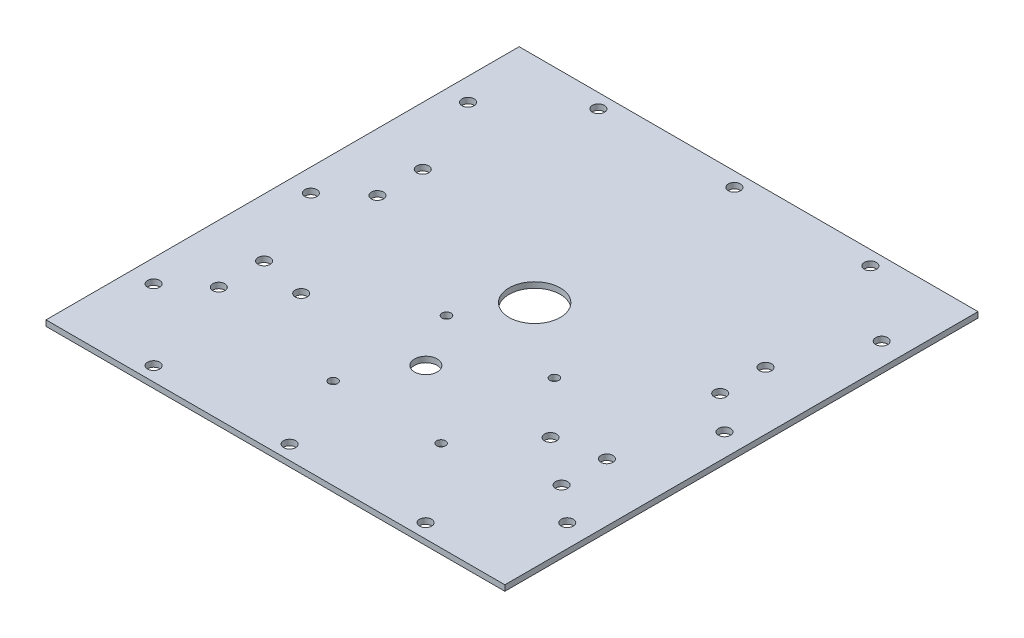
ISO-10303-21;
HEADER;
FILE_DESCRIPTION(('STEP AP214'),'2;1');
FILE_NAME('part.step','',(''),(''),'','','');
FILE_SCHEMA(('AUTOMOTIVE_DESIGN { 1 0 10303 214 1 1 1 1 }'));
ENDSEC;
DATA;
#1=APPLICATION_CONTEXT('core data for automotive mechanical design processes');
#2=APPLICATION_PROTOCOL_DEFINITION('international standard','automotive_design',2000,#1);
#3=PRODUCT_CONTEXT('',#1,'mechanical');
#4=PRODUCT('Part','Part','',(#3));
#5=PRODUCT_RELATED_PRODUCT_CATEGORY('part','',(#4));
#6=PRODUCT_DEFINITION_FORMATION('','',#4);
#7=PRODUCT_DEFINITION_CONTEXT('part definition',#1,'design');
#8=PRODUCT_DEFINITION('design','',#6,#7);
#9=PRODUCT_DEFINITION_SHAPE('','',#8);
#10=(LENGTH_UNIT() NAMED_UNIT(*) SI_UNIT(.MILLI.,.METRE.));
#11=(NAMED_UNIT(*) PLANE_ANGLE_UNIT() SI_UNIT($,.RADIAN.));
#12=(NAMED_UNIT(*) SI_UNIT($,.STERADIAN.) SOLID_ANGLE_UNIT());
#13=UNCERTAINTY_MEASURE_WITH_UNIT(LENGTH_MEASURE(1.E-05),#10,'distance_accuracy_value','');
#14=(GEOMETRIC_REPRESENTATION_CONTEXT(3) GLOBAL_UNCERTAINTY_ASSIGNED_CONTEXT((#13)) GLOBAL_UNIT_ASSIGNED_CONTEXT((#10,
#11,#12)) REPRESENTATION_CONTEXT('',''));
#15=CARTESIAN_POINT('',(0.,0.,0.));
#16=DIRECTION('',(0.,0.,1.));
#17=DIRECTION('',(1.,0.,0.));
#18=AXIS2_PLACEMENT_3D('',#15,#16,#17);
#19=CARTESIAN_POINT('',(-315.9125,-3.175,-265.1125));
#20=DIRECTION('',(0.,0.,-1.));
#21=DIRECTION('',(-1.,0.,0.));
#22=AXIS2_PLACEMENT_3D('',#19,#20,#21);
#23=PLANE('',#22);
#24=DIRECTION('',(0.,1.,0.));
#25=VECTOR('',#24,1.);
#26=CARTESIAN_POINT('',(-286.5125,-3.175,-265.1125));
#27=LINE('',#26,#25);
#28=CARTESIAN_POINT('',(-286.5125,-3.175,-265.1125));
#29=VERTEX_POINT('',#28);
#30=CARTESIAN_POINT('',(-286.5125,0.,-265.1125));
#31=VERTEX_POINT('',#30);
#32=EDGE_CURVE('E83',#29,#31,#27,.T.);
#33=ORIENTED_EDGE('',*,*,#32,.T.);
#34=DIRECTION('',(-1.,0.,0.));
#35=VECTOR('',#34,1.);
#36=CARTESIAN_POINT('',(-315.9125,0.,-265.1125));
#37=LINE('',#36,#35);
#38=CARTESIAN_POINT('',(-29.4,0.,-265.1125));
#39=VERTEX_POINT('',#38);
#40=EDGE_CURVE('E43',#39,#31,#37,.T.);
#41=ORIENTED_EDGE('',*,*,#40,.F.);
#42=DIRECTION('',(0.,1.,0.));
#43=VECTOR('',#42,1.);
#44=CARTESIAN_POINT('',(-29.4,-3.175,-265.1125));
#45=LINE('',#44,#43);
#46=CARTESIAN_POINT('',(-29.4,-3.175,-265.1125));
#47=VERTEX_POINT('',#46);
#48=EDGE_CURVE('E56',#47,#39,#45,.T.);
#49=ORIENTED_EDGE('',*,*,#48,.F.);
#50=DIRECTION('',(-1.,0.,0.));
#51=VECTOR('',#50,1.);
#52=CARTESIAN_POINT('',(-315.9125,-3.175,-265.1125));
#53=LINE('',#52,#51);
#54=EDGE_CURVE('E11',#47,#29,#53,.T.);
#55=ORIENTED_EDGE('',*,*,#54,.T.);
#56=EDGE_LOOP('',(#33,#41,#49,#55));
#57=FACE_BOUND('',#56,.T.);
#58=ADVANCED_FACE('F39',(#57),#23,.T.);
#59=CARTESIAN_POINT('',(-315.9125,-3.175,0.));
#60=DIRECTION('',(0.,0.,1.));
#61=DIRECTION('',(1.,0.,0.));
#62=AXIS2_PLACEMENT_3D('',#59,#60,#61);
#63=PLANE('',#62);
#64=DIRECTION('',(0.,1.,0.));
#65=VECTOR('',#64,1.);
#66=CARTESIAN_POINT('',(-286.5125,-3.175,0.));
#67=LINE('',#66,#65);
#68=CARTESIAN_POINT('',(-286.5125,-3.175,0.));
#69=VERTEX_POINT('',#68);
#70=CARTESIAN_POINT('',(-286.5125,0.,0.));
#71=VERTEX_POINT('',#70);
#72=EDGE_CURVE('E64',#69,#71,#67,.T.);
#73=ORIENTED_EDGE('',*,*,#72,.F.);
#74=DIRECTION('',(1.,0.,0.));
#75=VECTOR('',#74,1.);
#76=CARTESIAN_POINT('',(-315.9125,-3.175,0.));
#77=LINE('',#76,#75);
#78=CARTESIAN_POINT('',(-29.4,-3.175,0.));
#79=VERTEX_POINT('',#78);
#80=EDGE_CURVE('E48',#69,#79,#77,.T.);
#81=ORIENTED_EDGE('',*,*,#80,.T.);
#82=DIRECTION('',(0.,1.,0.));
#83=VECTOR('',#82,1.);
#84=CARTESIAN_POINT('',(-29.4,-3.175,0.));
#85=LINE('',#84,#83);
#86=CARTESIAN_POINT('',(-29.4,0.,0.));
#87=VERTEX_POINT('',#86);
#88=EDGE_CURVE('E275',#79,#87,#85,.T.);
#89=ORIENTED_EDGE('',*,*,#88,.T.);
#90=DIRECTION('',(1.,0.,0.));
#91=VECTOR('',#90,1.);
#92=CARTESIAN_POINT('',(-315.9125,0.,0.));
#93=LINE('',#92,#91);
#94=EDGE_CURVE('E94',#71,#87,#93,.T.);
#95=ORIENTED_EDGE('',*,*,#94,.F.);
#96=EDGE_LOOP('',(#73,#81,#89,#95));
#97=FACE_BOUND('',#96,.T.);
#98=ADVANCED_FACE('F41',(#97),#63,.T.);
#99=CARTESIAN_POINT('',(0.,-3.175,0.));
#100=DIRECTION('',(0.,-1.,0.));
#101=DIRECTION('',(0.,0.,-1.));
#102=AXIS2_PLACEMENT_3D('',#99,#100,#101);
#103=PLANE('',#102);
#104=DIRECTION('',(0.,0.,-1.));
#105=VECTOR('',#104,1.);
#106=CARTESIAN_POINT('',(-286.5125,-3.175,-265.1125));
#107=LINE('',#106,#105);
#108=EDGE_CURVE('E80',#69,#29,#107,.T.);
#109=ORIENTED_EDGE('',*,*,#108,.T.);
#110=ORIENTED_EDGE('',*,*,#54,.F.);
#111=DIRECTION('',(0.,0.,1.));
#112=VECTOR('',#111,1.);
#113=CARTESIAN_POINT('',(-29.4,-3.175,-265.1125));
#114=LINE('',#113,#112);
#115=EDGE_CURVE('E99',#47,#79,#114,.T.);
#116=ORIENTED_EDGE('',*,*,#115,.T.);
#117=ORIENTED_EDGE('',*,*,#80,.F.);
#118=EDGE_LOOP('',(#109,#110,#116,#117));
#119=FACE_BOUND('',#118,.T.);
#120=CARTESIAN_POINT('',(-42.06875,-3.175,-47.625));
#121=DIRECTION('',(0.,1.,0.));
#122=DIRECTION('',(0.,0.,-1.));
#123=AXIS2_PLACEMENT_3D('',#120,#121,#122);
#124=CIRCLE('',#123,3.37820000000002);
#125=CARTESIAN_POINT('',(-42.06875,-3.175,-51.0032));
#126=VERTEX_POINT('',#125);
#127=EDGE_CURVE('E266',#126,#126,#124,.T.);
#128=ORIENTED_EDGE('',*,*,#127,.T.);
#129=EDGE_LOOP('',(#128));
#130=FACE_BOUND('',#129,.T.);
#131=CARTESIAN_POINT('',(-42.06875,-3.175,-135.73125));
#132=DIRECTION('',(0.,1.,0.));
#133=DIRECTION('',(0.,0.,-1.));
#134=AXIS2_PLACEMENT_3D('',#131,#132,#133);
#135=CIRCLE('',#134,3.37819999999999);
#136=CARTESIAN_POINT('',(-42.06875,-3.175,-139.10945));
#137=VERTEX_POINT('',#136);
#138=EDGE_CURVE('E260',#137,#137,#135,.T.);
#139=ORIENTED_EDGE('',*,*,#138,.T.);
#140=EDGE_LOOP('',(#139));
#141=FACE_BOUND('',#140,.T.);
#142=CARTESIAN_POINT('',(-42.06875,-3.175,-223.8375));
#143=DIRECTION('',(0.,1.,0.));
#144=DIRECTION('',(0.,0.,-1.));
#145=AXIS2_PLACEMENT_3D('',#142,#143,#144);
#146=CIRCLE('',#145,3.37819999999999);
#147=CARTESIAN_POINT('',(-42.06875,-3.175,-227.2157));
#148=VERTEX_POINT('',#147);
#149=EDGE_CURVE('E254',#148,#148,#146,.T.);
#150=ORIENTED_EDGE('',*,*,#149,.T.);
#151=EDGE_LOOP('',(#150));
#152=FACE_BOUND('',#151,.T.);
#153=CARTESIAN_POINT('',(-273.84375,-3.175,-47.625));
#154=DIRECTION('',(0.,1.,0.));
#155=DIRECTION('',(0.,0.,1.));
#156=AXIS2_PLACEMENT_3D('',#153,#154,#155);
#157=CIRCLE('',#156,3.37819999999999);
#158=CARTESIAN_POINT('',(-273.84375,-3.175,-44.2468));
#159=VERTEX_POINT('',#158);
#160=EDGE_CURVE('E248',#159,#159,#157,.T.);
#161=ORIENTED_EDGE('',*,*,#160,.T.);
#162=EDGE_LOOP('',(#161));
#163=FACE_BOUND('',#162,.T.);
#164=CARTESIAN_POINT('',(-273.84375,-3.175,-135.73125));
#165=DIRECTION('',(0.,1.,0.));
#166=DIRECTION('',(0.,0.,1.));
#167=AXIS2_PLACEMENT_3D('',#164,#165,#166);
#168=CIRCLE('',#167,3.37819999999999);
#169=CARTESIAN_POINT('',(-273.84375,-3.175,-132.35305));
#170=VERTEX_POINT('',#169);
#171=EDGE_CURVE('E242',#170,#170,#168,.T.);
#172=ORIENTED_EDGE('',*,*,#171,.T.);
#173=EDGE_LOOP('',(#172));
#174=FACE_BOUND('',#173,.T.);
#175=CARTESIAN_POINT('',(-273.84375,-3.175,-223.8375));
#176=DIRECTION('',(0.,1.,0.));
#177=DIRECTION('',(0.,0.,1.));
#178=AXIS2_PLACEMENT_3D('',#175,#176,#177);
#179=CIRCLE('',#178,3.37819999999999);
#180=CARTESIAN_POINT('',(-273.84375,-3.175,-220.4593));
#181=VERTEX_POINT('',#180);
#182=EDGE_CURVE('E236',#181,#181,#179,.T.);
#183=ORIENTED_EDGE('',*,*,#182,.T.);
#184=EDGE_LOOP('',(#183));
#185=FACE_BOUND('',#184,.T.);
#186=CARTESIAN_POINT('',(-88.10625,-3.175,-84.29625));
#187=DIRECTION('',(0.,1.,0.));
#188=DIRECTION('',(0.,0.,1.));
#189=AXIS2_PLACEMENT_3D('',#186,#187,#188);
#190=CIRCLE('',#189,3.37819999999999);
#191=CARTESIAN_POINT('',(-88.10625,-3.175,-80.91805));
#192=VERTEX_POINT('',#191);
#193=EDGE_CURVE('E230',#192,#192,#190,.T.);
#194=ORIENTED_EDGE('',*,*,#193,.T.);
#195=EDGE_LOOP('',(#194));
#196=FACE_BOUND('',#195,.T.);
#197=CARTESIAN_POINT('',(-227.80625,-3.175,-84.29625));
#198=DIRECTION('',(0.,1.,0.));
#199=DIRECTION('',(0.,0.,1.));
#200=AXIS2_PLACEMENT_3D('',#197,#198,#199);
#201=CIRCLE('',#200,3.37819999999999);
#202=CARTESIAN_POINT('',(-227.80625,-3.175,-80.91805));
#203=VERTEX_POINT('',#202);
#204=EDGE_CURVE('E224',#203,#203,#201,.T.);
#205=ORIENTED_EDGE('',*,*,#204,.T.);
#206=EDGE_LOOP('',(#205));
#207=FACE_BOUND('',#206,.T.);
#208=CARTESIAN_POINT('',(-234.15625,-3.175,-257.175));
#209=DIRECTION('',(0.,1.,0.));
#210=DIRECTION('',(0.,0.,1.));
#211=AXIS2_PLACEMENT_3D('',#208,#209,#210);
#212=CIRCLE('',#211,3.37819999999999);
#213=CARTESIAN_POINT('',(-234.15625,-3.175,-253.7968));
#214=VERTEX_POINT('',#213);
#215=EDGE_CURVE('E218',#214,#214,#212,.T.);
#216=ORIENTED_EDGE('',*,*,#215,.T.);
#217=EDGE_LOOP('',(#216));
#218=FACE_BOUND('',#217,.T.);
#219=CARTESIAN_POINT('',(-81.75625,-3.175,-257.175));
#220=DIRECTION('',(0.,1.,0.));
#221=DIRECTION('',(0.,0.,1.));
#222=AXIS2_PLACEMENT_3D('',#219,#220,#221);
#223=CIRCLE('',#222,3.37819999999999);
#224=CARTESIAN_POINT('',(-81.75625,-3.175,-253.7968));
#225=VERTEX_POINT('',#224);
#226=EDGE_CURVE('E212',#225,#225,#223,.T.);
#227=ORIENTED_EDGE('',*,*,#226,.T.);
#228=EDGE_LOOP('',(#227));
#229=FACE_BOUND('',#228,.T.);
#230=CARTESIAN_POINT('',(-157.95625,-3.175,-257.175));
#231=DIRECTION('',(0.,1.,0.));
#232=DIRECTION('',(0.,0.,1.));
#233=AXIS2_PLACEMENT_3D('',#230,#231,#232);
#234=CIRCLE('',#233,3.37819999999999);
#235=CARTESIAN_POINT('',(-157.95625,-3.175,-253.7968));
#236=VERTEX_POINT('',#235);
#237=EDGE_CURVE('E206',#236,#236,#234,.T.);
#238=ORIENTED_EDGE('',*,*,#237,.T.);
#239=EDGE_LOOP('',(#238));
#240=FACE_BOUND('',#239,.T.);
#241=CARTESIAN_POINT('',(-81.75625,-3.175,-7.93750000000004));
#242=DIRECTION('',(0.,1.,0.));
#243=DIRECTION('',(0.,0.,1.));
#244=AXIS2_PLACEMENT_3D('',#241,#242,#243);
#245=CIRCLE('',#244,3.37819999999999);
#246=CARTESIAN_POINT('',(-81.75625,-3.175,-4.55930000000005));
#247=VERTEX_POINT('',#246);
#248=EDGE_CURVE('E200',#247,#247,#245,.T.);
#249=ORIENTED_EDGE('',*,*,#248,.T.);
#250=EDGE_LOOP('',(#249));
#251=FACE_BOUND('',#250,.T.);
#252=CARTESIAN_POINT('',(-157.95625,-3.175,-7.9375));
#253=DIRECTION('',(0.,1.,0.));
#254=DIRECTION('',(0.,0.,1.));
#255=AXIS2_PLACEMENT_3D('',#252,#253,#254);
#256=CIRCLE('',#255,3.37819999999999);
#257=CARTESIAN_POINT('',(-157.95625,-3.175,-4.55930000000001));
#258=VERTEX_POINT('',#257);
#259=EDGE_CURVE('E194',#258,#258,#256,.T.);
#260=ORIENTED_EDGE('',*,*,#259,.T.);
#261=EDGE_LOOP('',(#260));
#262=FACE_BOUND('',#261,.T.);
#263=CARTESIAN_POINT('',(-234.15625,-3.175,-7.93750000000004));
#264=DIRECTION('',(0.,1.,0.));
#265=DIRECTION('',(0.,0.,1.));
#266=AXIS2_PLACEMENT_3D('',#263,#264,#265);
#267=CIRCLE('',#266,3.37819999999999);
#268=CARTESIAN_POINT('',(-234.15625,-3.175,-4.55930000000005));
#269=VERTEX_POINT('',#268);
#270=EDGE_CURVE('E188',#269,#269,#267,.T.);
#271=ORIENTED_EDGE('',*,*,#270,.T.);
#272=EDGE_LOOP('',(#271));
#273=FACE_BOUND('',#272,.T.);
#274=CARTESIAN_POINT('',(-176.37125,-3.175,-50.76825));
#275=DIRECTION('',(0.,1.,0.));
#276=DIRECTION('',(0.,0.,1.));
#277=AXIS2_PLACEMENT_3D('',#274,#275,#276);
#278=CIRCLE('',#277,2.4892);
#279=CARTESIAN_POINT('',(-176.37125,-3.175,-48.27905));
#280=VERTEX_POINT('',#279);
#281=EDGE_CURVE('E182',#280,#280,#278,.T.);
#282=ORIENTED_EDGE('',*,*,#281,.T.);
#283=EDGE_LOOP('',(#282));
#284=FACE_BOUND('',#283,.T.);
#285=CARTESIAN_POINT('',(-115.91925,-3.175,-50.76825));
#286=DIRECTION('',(0.,1.,0.));
#287=DIRECTION('',(0.,0.,1.));
#288=AXIS2_PLACEMENT_3D('',#285,#286,#287);
#289=CIRCLE('',#288,2.4892);
#290=CARTESIAN_POINT('',(-115.91925,-3.175,-48.27905));
#291=VERTEX_POINT('',#290);
#292=EDGE_CURVE('E176',#291,#291,#289,.T.);
#293=ORIENTED_EDGE('',*,*,#292,.T.);
#294=EDGE_LOOP('',(#293));
#295=FACE_BOUND('',#294,.T.);
#296=CARTESIAN_POINT('',(-115.91925,-3.175,-114.26825));
#297=DIRECTION('',(0.,1.,0.));
#298=DIRECTION('',(0.,0.,1.));
#299=AXIS2_PLACEMENT_3D('',#296,#297,#298);
#300=CIRCLE('',#299,2.4892);
#301=CARTESIAN_POINT('',(-115.91925,-3.175,-111.77905));
#302=VERTEX_POINT('',#301);
#303=EDGE_CURVE('E170',#302,#302,#300,.T.);
#304=ORIENTED_EDGE('',*,*,#303,.T.);
#305=EDGE_LOOP('',(#304));
#306=FACE_BOUND('',#305,.T.);
#307=CARTESIAN_POINT('',(-176.37125,-3.175,-114.26825));
#308=DIRECTION('',(0.,1.,0.));
#309=DIRECTION('',(0.,0.,1.));
#310=AXIS2_PLACEMENT_3D('',#307,#308,#309);
#311=CIRCLE('',#310,2.4892);
#312=CARTESIAN_POINT('',(-176.37125,-3.175,-111.77905));
#313=VERTEX_POINT('',#312);
#314=EDGE_CURVE('E164',#313,#313,#311,.T.);
#315=ORIENTED_EDGE('',*,*,#314,.T.);
#316=EDGE_LOOP('',(#315));
#317=FACE_BOUND('',#316,.T.);
#318=CARTESIAN_POINT('',(-157.95625,-3.175,-84.29625));
#319=DIRECTION('',(0.,1.,0.));
#320=DIRECTION('',(0.,0.,1.));
#321=AXIS2_PLACEMENT_3D('',#318,#319,#320);
#322=CIRCLE('',#321,6.34999999999999);
#323=CARTESIAN_POINT('',(-157.95625,-3.175,-77.94625));
#324=VERTEX_POINT('',#323);
#325=EDGE_CURVE('E158',#324,#324,#322,.T.);
#326=ORIENTED_EDGE('',*,*,#325,.T.);
#327=EDGE_LOOP('',(#326));
#328=FACE_BOUND('',#327,.T.);
#329=CARTESIAN_POINT('',(-157.95625,-3.175,-145.25625));
#330=DIRECTION('',(0.,1.,0.));
#331=DIRECTION('',(0.,0.,1.));
#332=AXIS2_PLACEMENT_3D('',#329,#330,#331);
#333=CIRCLE('',#332,14.351);
#334=CARTESIAN_POINT('',(-157.95625,-3.175,-130.90525));
#335=VERTEX_POINT('',#334);
#336=EDGE_CURVE('E152',#335,#335,#333,.T.);
#337=ORIENTED_EDGE('',*,*,#336,.T.);
#338=EDGE_LOOP('',(#337));
#339=FACE_BOUND('',#338,.T.);
#340=CARTESIAN_POINT('',(-61.9125,-3.175,-178.59375));
#341=DIRECTION('',(0.,1.,0.));
#342=DIRECTION('',(0.,0.,-1.));
#343=AXIS2_PLACEMENT_3D('',#340,#341,#342);
#344=CIRCLE('',#343,3.37819999999999);
#345=CARTESIAN_POINT('',(-61.9125,-3.175,-181.97195));
#346=VERTEX_POINT('',#345);
#347=EDGE_CURVE('E146',#346,#346,#344,.T.);
#348=ORIENTED_EDGE('',*,*,#347,.T.);
#349=EDGE_LOOP('',(#348));
#350=FACE_BOUND('',#349,.T.);
#351=CARTESIAN_POINT('',(-61.9125,-3.175,-153.19375));
#352=DIRECTION('',(0.,1.,0.));
#353=DIRECTION('',(0.,0.,-1.));
#354=AXIS2_PLACEMENT_3D('',#351,#352,#353);
#355=CIRCLE('',#354,3.37820000000002);
#356=CARTESIAN_POINT('',(-61.9125,-3.175,-156.57195));
#357=VERTEX_POINT('',#356);
#358=EDGE_CURVE('E140',#357,#357,#355,.T.);
#359=ORIENTED_EDGE('',*,*,#358,.T.);
#360=EDGE_LOOP('',(#359));
#361=FACE_BOUND('',#360,.T.);
#362=CARTESIAN_POINT('',(-61.9125,-3.175,-89.69375));
#363=DIRECTION('',(0.,1.,0.));
#364=DIRECTION('',(0.,0.,-1.));
#365=AXIS2_PLACEMENT_3D('',#362,#363,#364);
#366=CIRCLE('',#365,3.37820000000002);
#367=CARTESIAN_POINT('',(-61.9125,-3.175,-93.07195));
#368=VERTEX_POINT('',#367);
#369=EDGE_CURVE('E134',#368,#368,#366,.T.);
#370=ORIENTED_EDGE('',*,*,#369,.T.);
#371=EDGE_LOOP('',(#370));
#372=FACE_BOUND('',#371,.T.);
#373=CARTESIAN_POINT('',(-61.9125,-3.175,-64.29375));
#374=DIRECTION('',(0.,1.,0.));
#375=DIRECTION('',(0.,0.,-1.));
#376=AXIS2_PLACEMENT_3D('',#373,#374,#375);
#377=CIRCLE('',#376,3.37819999999999);
#378=CARTESIAN_POINT('',(-61.9125,-3.175,-67.67195));
#379=VERTEX_POINT('',#378);
#380=EDGE_CURVE('E128',#379,#379,#377,.T.);
#381=ORIENTED_EDGE('',*,*,#380,.T.);
#382=EDGE_LOOP('',(#381));
#383=FACE_BOUND('',#382,.T.);
#384=CARTESIAN_POINT('',(-254.,-3.175,-178.59375));
#385=DIRECTION('',(0.,1.,0.));
#386=DIRECTION('',(0.,0.,1.));
#387=AXIS2_PLACEMENT_3D('',#384,#385,#386);
#388=CIRCLE('',#387,3.37819999999999);
#389=CARTESIAN_POINT('',(-254.,-3.175,-175.21555));
#390=VERTEX_POINT('',#389);
#391=EDGE_CURVE('E122',#390,#390,#388,.T.);
#392=ORIENTED_EDGE('',*,*,#391,.T.);
#393=EDGE_LOOP('',(#392));
#394=FACE_BOUND('',#393,.T.);
#395=CARTESIAN_POINT('',(-254.,-3.175,-153.19375));
#396=DIRECTION('',(0.,1.,0.));
#397=DIRECTION('',(0.,0.,1.));
#398=AXIS2_PLACEMENT_3D('',#395,#396,#397);
#399=CIRCLE('',#398,3.37819999999999);
#400=CARTESIAN_POINT('',(-254.,-3.175,-149.81555));
#401=VERTEX_POINT('',#400);
#402=EDGE_CURVE('E116',#401,#401,#399,.T.);
#403=ORIENTED_EDGE('',*,*,#402,.T.);
#404=EDGE_LOOP('',(#403));
#405=FACE_BOUND('',#404,.T.);
#406=CARTESIAN_POINT('',(-254.,-3.175,-89.69375));
#407=DIRECTION('',(0.,1.,0.));
#408=DIRECTION('',(0.,0.,1.));
#409=AXIS2_PLACEMENT_3D('',#406,#407,#408);
#410=CIRCLE('',#409,3.37819999999999);
#411=CARTESIAN_POINT('',(-254.,-3.175,-86.31555));
#412=VERTEX_POINT('',#411);
#413=EDGE_CURVE('E111',#412,#412,#410,.T.);
#414=ORIENTED_EDGE('',*,*,#413,.T.);
#415=EDGE_LOOP('',(#414));
#416=FACE_BOUND('',#415,.T.);
#417=CARTESIAN_POINT('',(-254.,-3.175,-64.29375));
#418=DIRECTION('',(0.,1.,0.));
#419=DIRECTION('',(0.,0.,1.));
#420=AXIS2_PLACEMENT_3D('',#417,#418,#419);
#421=CIRCLE('',#420,3.37819999999999);
#422=CARTESIAN_POINT('',(-254.,-3.175,-60.91555));
#423=VERTEX_POINT('',#422);
#424=EDGE_CURVE('E105',#423,#423,#421,.T.);
#425=ORIENTED_EDGE('',*,*,#424,.T.);
#426=EDGE_LOOP('',(#425));
#427=FACE_BOUND('',#426,.T.);
#428=ADVANCED_FACE('F97',(#119,#130,#141,#152,#163,#174,#185,#196,#207,#218,#229,#240,#251,#262,
#273,#284,#295,#306,#317,#328,#339,#350,#361,#372,#383,#394,#405,#416,#427),#103,.T.);
#429=CARTESIAN_POINT('',(0.,0.,0.));
#430=DIRECTION('',(0.,-1.,0.));
#431=DIRECTION('',(0.,0.,-1.));
#432=AXIS2_PLACEMENT_3D('',#429,#430,#431);
#433=PLANE('',#432);
#434=CARTESIAN_POINT('',(-42.06875,0.,-47.625));
#435=DIRECTION('',(0.,1.,0.));
#436=DIRECTION('',(0.,0.,-1.));
#437=AXIS2_PLACEMENT_3D('',#434,#435,#436);
#438=CIRCLE('',#437,3.37820000000002);
#439=CARTESIAN_POINT('',(-42.06875,0.,-51.0032));
#440=VERTEX_POINT('',#439);
#441=EDGE_CURVE('E269',#440,#440,#438,.T.);
#442=ORIENTED_EDGE('',*,*,#441,.F.);
#443=EDGE_LOOP('',(#442));
#444=FACE_BOUND('',#443,.T.);
#445=CARTESIAN_POINT('',(-42.06875,0.,-135.73125));
#446=DIRECTION('',(0.,1.,0.));
#447=DIRECTION('',(0.,0.,-1.));
#448=AXIS2_PLACEMENT_3D('',#445,#446,#447);
#449=CIRCLE('',#448,3.37819999999999);
#450=CARTESIAN_POINT('',(-42.06875,0.,-139.10945));
#451=VERTEX_POINT('',#450);
#452=EDGE_CURVE('E263',#451,#451,#449,.T.);
#453=ORIENTED_EDGE('',*,*,#452,.F.);
#454=EDGE_LOOP('',(#453));
#455=FACE_BOUND('',#454,.T.);
#456=CARTESIAN_POINT('',(-42.06875,0.,-223.8375));
#457=DIRECTION('',(0.,1.,0.));
#458=DIRECTION('',(0.,0.,-1.));
#459=AXIS2_PLACEMENT_3D('',#456,#457,#458);
#460=CIRCLE('',#459,3.37819999999999);
#461=CARTESIAN_POINT('',(-42.06875,0.,-227.2157));
#462=VERTEX_POINT('',#461);
#463=EDGE_CURVE('E257',#462,#462,#460,.T.);
#464=ORIENTED_EDGE('',*,*,#463,.F.);
#465=EDGE_LOOP('',(#464));
#466=FACE_BOUND('',#465,.T.);
#467=CARTESIAN_POINT('',(-273.84375,0.,-47.625));
#468=DIRECTION('',(0.,1.,0.));
#469=DIRECTION('',(0.,0.,1.));
#470=AXIS2_PLACEMENT_3D('',#467,#468,#469);
#471=CIRCLE('',#470,3.37819999999999);
#472=CARTESIAN_POINT('',(-273.84375,0.,-44.2468));
#473=VERTEX_POINT('',#472);
#474=EDGE_CURVE('E251',#473,#473,#471,.T.);
#475=ORIENTED_EDGE('',*,*,#474,.F.);
#476=EDGE_LOOP('',(#475));
#477=FACE_BOUND('',#476,.T.);
#478=CARTESIAN_POINT('',(-273.84375,0.,-135.73125));
#479=DIRECTION('',(0.,1.,0.));
#480=DIRECTION('',(0.,0.,1.));
#481=AXIS2_PLACEMENT_3D('',#478,#479,#480);
#482=CIRCLE('',#481,3.37819999999999);
#483=CARTESIAN_POINT('',(-273.84375,0.,-132.35305));
#484=VERTEX_POINT('',#483);
#485=EDGE_CURVE('E245',#484,#484,#482,.T.);
#486=ORIENTED_EDGE('',*,*,#485,.F.);
#487=EDGE_LOOP('',(#486));
#488=FACE_BOUND('',#487,.T.);
#489=CARTESIAN_POINT('',(-273.84375,0.,-223.8375));
#490=DIRECTION('',(0.,1.,0.));
#491=DIRECTION('',(0.,0.,1.));
#492=AXIS2_PLACEMENT_3D('',#489,#490,#491);
#493=CIRCLE('',#492,3.37819999999999);
#494=CARTESIAN_POINT('',(-273.84375,0.,-220.4593));
#495=VERTEX_POINT('',#494);
#496=EDGE_CURVE('E239',#495,#495,#493,.T.);
#497=ORIENTED_EDGE('',*,*,#496,.F.);
#498=EDGE_LOOP('',(#497));
#499=FACE_BOUND('',#498,.T.);
#500=CARTESIAN_POINT('',(-88.10625,0.,-84.29625));
#501=DIRECTION('',(0.,1.,0.));
#502=DIRECTION('',(0.,0.,1.));
#503=AXIS2_PLACEMENT_3D('',#500,#501,#502);
#504=CIRCLE('',#503,3.37819999999999);
#505=CARTESIAN_POINT('',(-88.10625,0.,-80.91805));
#506=VERTEX_POINT('',#505);
#507=EDGE_CURVE('E233',#506,#506,#504,.T.);
#508=ORIENTED_EDGE('',*,*,#507,.F.);
#509=EDGE_LOOP('',(#508));
#510=FACE_BOUND('',#509,.T.);
#511=CARTESIAN_POINT('',(-227.80625,0.,-84.29625));
#512=DIRECTION('',(0.,1.,0.));
#513=DIRECTION('',(0.,0.,1.));
#514=AXIS2_PLACEMENT_3D('',#511,#512,#513);
#515=CIRCLE('',#514,3.37819999999999);
#516=CARTESIAN_POINT('',(-227.80625,0.,-80.91805));
#517=VERTEX_POINT('',#516);
#518=EDGE_CURVE('E227',#517,#517,#515,.T.);
#519=ORIENTED_EDGE('',*,*,#518,.F.);
#520=EDGE_LOOP('',(#519));
#521=FACE_BOUND('',#520,.T.);
#522=CARTESIAN_POINT('',(-234.15625,0.,-257.175));
#523=DIRECTION('',(0.,1.,0.));
#524=DIRECTION('',(0.,0.,1.));
#525=AXIS2_PLACEMENT_3D('',#522,#523,#524);
#526=CIRCLE('',#525,3.37819999999999);
#527=CARTESIAN_POINT('',(-234.15625,0.,-253.7968));
#528=VERTEX_POINT('',#527);
#529=EDGE_CURVE('E221',#528,#528,#526,.T.);
#530=ORIENTED_EDGE('',*,*,#529,.F.);
#531=EDGE_LOOP('',(#530));
#532=FACE_BOUND('',#531,.T.);
#533=CARTESIAN_POINT('',(-81.75625,0.,-257.175));
#534=DIRECTION('',(0.,1.,0.));
#535=DIRECTION('',(0.,0.,1.));
#536=AXIS2_PLACEMENT_3D('',#533,#534,#535);
#537=CIRCLE('',#536,3.37819999999999);
#538=CARTESIAN_POINT('',(-81.75625,0.,-253.7968));
#539=VERTEX_POINT('',#538);
#540=EDGE_CURVE('E215',#539,#539,#537,.T.);
#541=ORIENTED_EDGE('',*,*,#540,.F.);
#542=EDGE_LOOP('',(#541));
#543=FACE_BOUND('',#542,.T.);
#544=CARTESIAN_POINT('',(-157.95625,0.,-257.175));
#545=DIRECTION('',(0.,1.,0.));
#546=DIRECTION('',(0.,0.,1.));
#547=AXIS2_PLACEMENT_3D('',#544,#545,#546);
#548=CIRCLE('',#547,3.37819999999999);
#549=CARTESIAN_POINT('',(-157.95625,0.,-253.7968));
#550=VERTEX_POINT('',#549);
#551=EDGE_CURVE('E209',#550,#550,#548,.T.);
#552=ORIENTED_EDGE('',*,*,#551,.F.);
#553=EDGE_LOOP('',(#552));
#554=FACE_BOUND('',#553,.T.);
#555=CARTESIAN_POINT('',(-81.75625,0.,-7.93750000000004));
#556=DIRECTION('',(0.,1.,0.));
#557=DIRECTION('',(0.,0.,1.));
#558=AXIS2_PLACEMENT_3D('',#555,#556,#557);
#559=CIRCLE('',#558,3.37819999999999);
#560=CARTESIAN_POINT('',(-81.75625,0.,-4.55930000000005));
#561=VERTEX_POINT('',#560);
#562=EDGE_CURVE('E203',#561,#561,#559,.T.);
#563=ORIENTED_EDGE('',*,*,#562,.F.);
#564=EDGE_LOOP('',(#563));
#565=FACE_BOUND('',#564,.T.);
#566=CARTESIAN_POINT('',(-157.95625,0.,-7.9375));
#567=DIRECTION('',(0.,1.,0.));
#568=DIRECTION('',(0.,0.,1.));
#569=AXIS2_PLACEMENT_3D('',#566,#567,#568);
#570=CIRCLE('',#569,3.37819999999999);
#571=CARTESIAN_POINT('',(-157.95625,0.,-4.55930000000001));
#572=VERTEX_POINT('',#571);
#573=EDGE_CURVE('E197',#572,#572,#570,.T.);
#574=ORIENTED_EDGE('',*,*,#573,.F.);
#575=EDGE_LOOP('',(#574));
#576=FACE_BOUND('',#575,.T.);
#577=CARTESIAN_POINT('',(-234.15625,0.,-7.93750000000004));
#578=DIRECTION('',(0.,1.,0.));
#579=DIRECTION('',(0.,0.,1.));
#580=AXIS2_PLACEMENT_3D('',#577,#578,#579);
#581=CIRCLE('',#580,3.37819999999999);
#582=CARTESIAN_POINT('',(-234.15625,0.,-4.55930000000005));
#583=VERTEX_POINT('',#582);
#584=EDGE_CURVE('E191',#583,#583,#581,.T.);
#585=ORIENTED_EDGE('',*,*,#584,.F.);
#586=EDGE_LOOP('',(#585));
#587=FACE_BOUND('',#586,.T.);
#588=CARTESIAN_POINT('',(-176.37125,0.,-50.76825));
#589=DIRECTION('',(0.,1.,0.));
#590=DIRECTION('',(0.,0.,1.));
#591=AXIS2_PLACEMENT_3D('',#588,#589,#590);
#592=CIRCLE('',#591,2.4892);
#593=CARTESIAN_POINT('',(-176.37125,0.,-48.27905));
#594=VERTEX_POINT('',#593);
#595=EDGE_CURVE('E185',#594,#594,#592,.T.);
#596=ORIENTED_EDGE('',*,*,#595,.F.);
#597=EDGE_LOOP('',(#596));
#598=FACE_BOUND('',#597,.T.);
#599=CARTESIAN_POINT('',(-115.91925,0.,-50.76825));
#600=DIRECTION('',(0.,1.,0.));
#601=DIRECTION('',(0.,0.,1.));
#602=AXIS2_PLACEMENT_3D('',#599,#600,#601);
#603=CIRCLE('',#602,2.4892);
#604=CARTESIAN_POINT('',(-115.91925,0.,-48.27905));
#605=VERTEX_POINT('',#604);
#606=EDGE_CURVE('E179',#605,#605,#603,.T.);
#607=ORIENTED_EDGE('',*,*,#606,.F.);
#608=EDGE_LOOP('',(#607));
#609=FACE_BOUND('',#608,.T.);
#610=CARTESIAN_POINT('',(-115.91925,0.,-114.26825));
#611=DIRECTION('',(0.,1.,0.));
#612=DIRECTION('',(0.,0.,1.));
#613=AXIS2_PLACEMENT_3D('',#610,#611,#612);
#614=CIRCLE('',#613,2.4892);
#615=CARTESIAN_POINT('',(-115.91925,0.,-111.77905));
#616=VERTEX_POINT('',#615);
#617=EDGE_CURVE('E173',#616,#616,#614,.T.);
#618=ORIENTED_EDGE('',*,*,#617,.F.);
#619=EDGE_LOOP('',(#618));
#620=FACE_BOUND('',#619,.T.);
#621=CARTESIAN_POINT('',(-176.37125,0.,-114.26825));
#622=DIRECTION('',(0.,1.,0.));
#623=DIRECTION('',(0.,0.,1.));
#624=AXIS2_PLACEMENT_3D('',#621,#622,#623);
#625=CIRCLE('',#624,2.4892);
#626=CARTESIAN_POINT('',(-176.37125,0.,-111.77905));
#627=VERTEX_POINT('',#626);
#628=EDGE_CURVE('E167',#627,#627,#625,.T.);
#629=ORIENTED_EDGE('',*,*,#628,.F.);
#630=EDGE_LOOP('',(#629));
#631=FACE_BOUND('',#630,.T.);
#632=CARTESIAN_POINT('',(-157.95625,0.,-84.29625));
#633=DIRECTION('',(0.,1.,0.));
#634=DIRECTION('',(0.,0.,1.));
#635=AXIS2_PLACEMENT_3D('',#632,#633,#634);
#636=CIRCLE('',#635,6.34999999999999);
#637=CARTESIAN_POINT('',(-157.95625,0.,-77.94625));
#638=VERTEX_POINT('',#637);
#639=EDGE_CURVE('E161',#638,#638,#636,.T.);
#640=ORIENTED_EDGE('',*,*,#639,.F.);
#641=EDGE_LOOP('',(#640));
#642=FACE_BOUND('',#641,.T.);
#643=CARTESIAN_POINT('',(-157.95625,0.,-145.25625));
#644=DIRECTION('',(0.,1.,0.));
#645=DIRECTION('',(0.,0.,1.));
#646=AXIS2_PLACEMENT_3D('',#643,#644,#645);
#647=CIRCLE('',#646,14.351);
#648=CARTESIAN_POINT('',(-157.95625,0.,-130.90525));
#649=VERTEX_POINT('',#648);
#650=EDGE_CURVE('E155',#649,#649,#647,.T.);
#651=ORIENTED_EDGE('',*,*,#650,.F.);
#652=EDGE_LOOP('',(#651));
#653=FACE_BOUND('',#652,.T.);
#654=CARTESIAN_POINT('',(-61.9125,0.,-178.59375));
#655=DIRECTION('',(0.,1.,0.));
#656=DIRECTION('',(0.,0.,-1.));
#657=AXIS2_PLACEMENT_3D('',#654,#655,#656);
#658=CIRCLE('',#657,3.37819999999999);
#659=CARTESIAN_POINT('',(-61.9125,0.,-181.97195));
#660=VERTEX_POINT('',#659);
#661=EDGE_CURVE('E149',#660,#660,#658,.T.);
#662=ORIENTED_EDGE('',*,*,#661,.F.);
#663=EDGE_LOOP('',(#662));
#664=FACE_BOUND('',#663,.T.);
#665=CARTESIAN_POINT('',(-61.9125,0.,-153.19375));
#666=DIRECTION('',(0.,1.,0.));
#667=DIRECTION('',(0.,0.,-1.));
#668=AXIS2_PLACEMENT_3D('',#665,#666,#667);
#669=CIRCLE('',#668,3.37820000000002);
#670=CARTESIAN_POINT('',(-61.9125,0.,-156.57195));
#671=VERTEX_POINT('',#670);
#672=EDGE_CURVE('E143',#671,#671,#669,.T.);
#673=ORIENTED_EDGE('',*,*,#672,.F.);
#674=EDGE_LOOP('',(#673));
#675=FACE_BOUND('',#674,.T.);
#676=CARTESIAN_POINT('',(-61.9125,0.,-89.69375));
#677=DIRECTION('',(0.,1.,0.));
#678=DIRECTION('',(0.,0.,-1.));
#679=AXIS2_PLACEMENT_3D('',#676,#677,#678);
#680=CIRCLE('',#679,3.37820000000002);
#681=CARTESIAN_POINT('',(-61.9125,0.,-93.07195));
#682=VERTEX_POINT('',#681);
#683=EDGE_CURVE('E137',#682,#682,#680,.T.);
#684=ORIENTED_EDGE('',*,*,#683,.F.);
#685=EDGE_LOOP('',(#684));
#686=FACE_BOUND('',#685,.T.);
#687=CARTESIAN_POINT('',(-61.9125,0.,-64.29375));
#688=DIRECTION('',(0.,1.,0.));
#689=DIRECTION('',(0.,0.,-1.));
#690=AXIS2_PLACEMENT_3D('',#687,#688,#689);
#691=CIRCLE('',#690,3.37819999999999);
#692=CARTESIAN_POINT('',(-61.9125,0.,-67.67195));
#693=VERTEX_POINT('',#692);
#694=EDGE_CURVE('E131',#693,#693,#691,.T.);
#695=ORIENTED_EDGE('',*,*,#694,.F.);
#696=EDGE_LOOP('',(#695));
#697=FACE_BOUND('',#696,.T.);
#698=CARTESIAN_POINT('',(-254.,0.,-178.59375));
#699=DIRECTION('',(0.,1.,0.));
#700=DIRECTION('',(0.,0.,1.));
#701=AXIS2_PLACEMENT_3D('',#698,#699,#700);
#702=CIRCLE('',#701,3.37819999999999);
#703=CARTESIAN_POINT('',(-254.,0.,-175.21555));
#704=VERTEX_POINT('',#703);
#705=EDGE_CURVE('E125',#704,#704,#702,.T.);
#706=ORIENTED_EDGE('',*,*,#705,.F.);
#707=EDGE_LOOP('',(#706));
#708=FACE_BOUND('',#707,.T.);
#709=CARTESIAN_POINT('',(-254.,0.,-153.19375));
#710=DIRECTION('',(0.,1.,0.));
#711=DIRECTION('',(0.,0.,1.));
#712=AXIS2_PLACEMENT_3D('',#709,#710,#711);
#713=CIRCLE('',#712,3.37819999999999);
#714=CARTESIAN_POINT('',(-254.,0.,-149.81555));
#715=VERTEX_POINT('',#714);
#716=EDGE_CURVE('E119',#715,#715,#713,.T.);
#717=ORIENTED_EDGE('',*,*,#716,.F.);
#718=EDGE_LOOP('',(#717));
#719=FACE_BOUND('',#718,.T.);
#720=CARTESIAN_POINT('',(-254.,0.,-89.69375));
#721=DIRECTION('',(0.,1.,0.));
#722=DIRECTION('',(0.,0.,1.));
#723=AXIS2_PLACEMENT_3D('',#720,#721,#722);
#724=CIRCLE('',#723,3.37819999999999);
#725=CARTESIAN_POINT('',(-254.,0.,-86.31555));
#726=VERTEX_POINT('',#725);
#727=EDGE_CURVE('E113',#726,#726,#724,.T.);
#728=ORIENTED_EDGE('',*,*,#727,.F.);
#729=EDGE_LOOP('',(#728));
#730=FACE_BOUND('',#729,.T.);
#731=CARTESIAN_POINT('',(-254.,0.,-64.29375));
#732=DIRECTION('',(0.,1.,0.));
#733=DIRECTION('',(0.,0.,1.));
#734=AXIS2_PLACEMENT_3D('',#731,#732,#733);
#735=CIRCLE('',#734,3.37819999999999);
#736=CARTESIAN_POINT('',(-254.,0.,-60.91555));
#737=VERTEX_POINT('',#736);
#738=EDGE_CURVE('E103',#737,#737,#735,.T.);
#739=ORIENTED_EDGE('',*,*,#738,.F.);
#740=EDGE_LOOP('',(#739));
#741=FACE_BOUND('',#740,.T.);
#742=ORIENTED_EDGE('',*,*,#40,.T.);
#743=DIRECTION('',(0.,0.,-1.));
#744=VECTOR('',#743,1.);
#745=CARTESIAN_POINT('',(-286.5125,0.,-265.1125));
#746=LINE('',#745,#744);
#747=EDGE_CURVE('E87',#71,#31,#746,.T.);
#748=ORIENTED_EDGE('',*,*,#747,.F.);
#749=ORIENTED_EDGE('',*,*,#94,.T.);
#750=DIRECTION('',(0.,0.,1.));
#751=VECTOR('',#750,1.);
#752=CARTESIAN_POINT('',(-29.4,0.,-265.1125));
#753=LINE('',#752,#751);
#754=EDGE_CURVE('E277',#39,#87,#753,.T.);
#755=ORIENTED_EDGE('',*,*,#754,.F.);
#756=EDGE_LOOP('',(#742,#748,#749,#755));
#757=FACE_BOUND('',#756,.T.);
#758=ADVANCED_FACE('F283',(#444,#455,#466,#477,#488,#499,#510,#521,#532,#543,#554,#565,#576,
#587,#598,#609,#620,#631,#642,#653,#664,#675,#686,#697,#708,#719,#730,#741,#757),#433,.F.);
#759=CARTESIAN_POINT('',(-254.,-3.175,-64.29375));
#760=DIRECTION('',(0.,1.,0.));
#761=DIRECTION('',(0.,0.,1.));
#762=AXIS2_PLACEMENT_3D('',#759,#760,#761);
#763=CYLINDRICAL_SURFACE('',#762,3.37819999999999);
#764=ORIENTED_EDGE('',*,*,#424,.F.);
#765=EDGE_LOOP('',(#764));
#766=FACE_BOUND('',#765,.T.);
#767=ORIENTED_EDGE('',*,*,#738,.T.);
#768=EDGE_LOOP('',(#767));
#769=FACE_BOUND('',#768,.T.);
#770=ADVANCED_FACE('F303',(#766,#769),#763,.F.);
#771=CARTESIAN_POINT('',(-254.,-3.175,-89.69375));
#772=DIRECTION('',(0.,1.,0.));
#773=DIRECTION('',(0.,0.,1.));
#774=AXIS2_PLACEMENT_3D('',#771,#772,#773);
#775=CYLINDRICAL_SURFACE('',#774,3.37819999999999);
#776=ORIENTED_EDGE('',*,*,#413,.F.);
#777=EDGE_LOOP('',(#776));
#778=FACE_BOUND('',#777,.T.);
#779=ORIENTED_EDGE('',*,*,#727,.T.);
#780=EDGE_LOOP('',(#779));
#781=FACE_BOUND('',#780,.T.);
#782=ADVANCED_FACE('F309',(#778,#781),#775,.F.);
#783=CARTESIAN_POINT('',(-254.,-3.175,-153.19375));
#784=DIRECTION('',(0.,1.,0.));
#785=DIRECTION('',(0.,0.,1.));
#786=AXIS2_PLACEMENT_3D('',#783,#784,#785);
#787=CYLINDRICAL_SURFACE('',#786,3.37819999999999);
#788=ORIENTED_EDGE('',*,*,#402,.F.);
#789=EDGE_LOOP('',(#788));
#790=FACE_BOUND('',#789,.T.);
#791=ORIENTED_EDGE('',*,*,#716,.T.);
#792=EDGE_LOOP('',(#791));
#793=FACE_BOUND('',#792,.T.);
#794=ADVANCED_FACE('F313',(#790,#793),#787,.F.);
#795=CARTESIAN_POINT('',(-254.,-3.175,-178.59375));
#796=DIRECTION('',(0.,1.,0.));
#797=DIRECTION('',(0.,0.,1.));
#798=AXIS2_PLACEMENT_3D('',#795,#796,#797);
#799=CYLINDRICAL_SURFACE('',#798,3.37819999999999);
#800=ORIENTED_EDGE('',*,*,#391,.F.);
#801=EDGE_LOOP('',(#800));
#802=FACE_BOUND('',#801,.T.);
#803=ORIENTED_EDGE('',*,*,#705,.T.);
#804=EDGE_LOOP('',(#803));
#805=FACE_BOUND('',#804,.T.);
#806=ADVANCED_FACE('F317',(#802,#805),#799,.F.);
#807=CARTESIAN_POINT('',(-61.9125,-3.175,-64.29375));
#808=DIRECTION('',(0.,1.,0.));
#809=DIRECTION('',(0.,0.,1.));
#810=AXIS2_PLACEMENT_3D('',#807,#808,#809);
#811=CYLINDRICAL_SURFACE('',#810,3.37819999999999);
#812=ORIENTED_EDGE('',*,*,#380,.F.);
#813=EDGE_LOOP('',(#812));
#814=FACE_BOUND('',#813,.T.);
#815=ORIENTED_EDGE('',*,*,#694,.T.);
#816=EDGE_LOOP('',(#815));
#817=FACE_BOUND('',#816,.T.);
#818=ADVANCED_FACE('F321',(#814,#817),#811,.F.);
#819=CARTESIAN_POINT('',(-61.9125,-3.175,-89.69375));
#820=DIRECTION('',(0.,1.,0.));
#821=DIRECTION('',(0.,0.,1.));
#822=AXIS2_PLACEMENT_3D('',#819,#820,#821);
#823=CYLINDRICAL_SURFACE('',#822,3.37820000000002);
#824=ORIENTED_EDGE('',*,*,#369,.F.);
#825=EDGE_LOOP('',(#824));
#826=FACE_BOUND('',#825,.T.);
#827=ORIENTED_EDGE('',*,*,#683,.T.);
#828=EDGE_LOOP('',(#827));
#829=FACE_BOUND('',#828,.T.);
#830=ADVANCED_FACE('F325',(#826,#829),#823,.F.);
#831=CARTESIAN_POINT('',(-61.9125,-3.175,-153.19375));
#832=DIRECTION('',(0.,1.,0.));
#833=DIRECTION('',(0.,0.,1.));
#834=AXIS2_PLACEMENT_3D('',#831,#832,#833);
#835=CYLINDRICAL_SURFACE('',#834,3.37820000000002);
#836=ORIENTED_EDGE('',*,*,#358,.F.);
#837=EDGE_LOOP('',(#836));
#838=FACE_BOUND('',#837,.T.);
#839=ORIENTED_EDGE('',*,*,#672,.T.);
#840=EDGE_LOOP('',(#839));
#841=FACE_BOUND('',#840,.T.);
#842=ADVANCED_FACE('F329',(#838,#841),#835,.F.);
#843=CARTESIAN_POINT('',(-61.9125,-3.175,-178.59375));
#844=DIRECTION('',(0.,1.,0.));
#845=DIRECTION('',(0.,0.,1.));
#846=AXIS2_PLACEMENT_3D('',#843,#844,#845);
#847=CYLINDRICAL_SURFACE('',#846,3.37819999999999);
#848=ORIENTED_EDGE('',*,*,#347,.F.);
#849=EDGE_LOOP('',(#848));
#850=FACE_BOUND('',#849,.T.);
#851=ORIENTED_EDGE('',*,*,#661,.T.);
#852=EDGE_LOOP('',(#851));
#853=FACE_BOUND('',#852,.T.);
#854=ADVANCED_FACE('F333',(#850,#853),#847,.F.);
#855=CARTESIAN_POINT('',(-157.95625,-3.175,-145.25625));
#856=DIRECTION('',(0.,1.,0.));
#857=DIRECTION('',(0.,0.,1.));
#858=AXIS2_PLACEMENT_3D('',#855,#856,#857);
#859=CYLINDRICAL_SURFACE('',#858,14.351);
#860=ORIENTED_EDGE('',*,*,#336,.F.);
#861=EDGE_LOOP('',(#860));
#862=FACE_BOUND('',#861,.T.);
#863=ORIENTED_EDGE('',*,*,#650,.T.);
#864=EDGE_LOOP('',(#863));
#865=FACE_BOUND('',#864,.T.);
#866=ADVANCED_FACE('F337',(#862,#865),#859,.F.);
#867=CARTESIAN_POINT('',(-157.95625,-3.175,-84.29625));
#868=DIRECTION('',(0.,1.,0.));
#869=DIRECTION('',(0.,0.,1.));
#870=AXIS2_PLACEMENT_3D('',#867,#868,#869);
#871=CYLINDRICAL_SURFACE('',#870,6.34999999999999);
#872=ORIENTED_EDGE('',*,*,#325,.F.);
#873=EDGE_LOOP('',(#872));
#874=FACE_BOUND('',#873,.T.);
#875=ORIENTED_EDGE('',*,*,#639,.T.);
#876=EDGE_LOOP('',(#875));
#877=FACE_BOUND('',#876,.T.);
#878=ADVANCED_FACE('F341',(#874,#877),#871,.F.);
#879=CARTESIAN_POINT('',(-176.37125,-3.175,-114.26825));
#880=DIRECTION('',(0.,1.,0.));
#881=DIRECTION('',(0.,0.,1.));
#882=AXIS2_PLACEMENT_3D('',#879,#880,#881);
#883=CYLINDRICAL_SURFACE('',#882,2.4892);
#884=ORIENTED_EDGE('',*,*,#314,.F.);
#885=EDGE_LOOP('',(#884));
#886=FACE_BOUND('',#885,.T.);
#887=ORIENTED_EDGE('',*,*,#628,.T.);
#888=EDGE_LOOP('',(#887));
#889=FACE_BOUND('',#888,.T.);
#890=ADVANCED_FACE('F345',(#886,#889),#883,.F.);
#891=CARTESIAN_POINT('',(-115.91925,-3.175,-114.26825));
#892=DIRECTION('',(0.,1.,0.));
#893=DIRECTION('',(0.,0.,1.));
#894=AXIS2_PLACEMENT_3D('',#891,#892,#893);
#895=CYLINDRICAL_SURFACE('',#894,2.4892);
#896=ORIENTED_EDGE('',*,*,#303,.F.);
#897=EDGE_LOOP('',(#896));
#898=FACE_BOUND('',#897,.T.);
#899=ORIENTED_EDGE('',*,*,#617,.T.);
#900=EDGE_LOOP('',(#899));
#901=FACE_BOUND('',#900,.T.);
#902=ADVANCED_FACE('F349',(#898,#901),#895,.F.);
#903=CARTESIAN_POINT('',(-115.91925,-3.175,-50.76825));
#904=DIRECTION('',(0.,1.,0.));
#905=DIRECTION('',(0.,0.,1.));
#906=AXIS2_PLACEMENT_3D('',#903,#904,#905);
#907=CYLINDRICAL_SURFACE('',#906,2.4892);
#908=ORIENTED_EDGE('',*,*,#292,.F.);
#909=EDGE_LOOP('',(#908));
#910=FACE_BOUND('',#909,.T.);
#911=ORIENTED_EDGE('',*,*,#606,.T.);
#912=EDGE_LOOP('',(#911));
#913=FACE_BOUND('',#912,.T.);
#914=ADVANCED_FACE('F353',(#910,#913),#907,.F.);
#915=CARTESIAN_POINT('',(-176.37125,-3.175,-50.76825));
#916=DIRECTION('',(0.,1.,0.));
#917=DIRECTION('',(0.,0.,1.));
#918=AXIS2_PLACEMENT_3D('',#915,#916,#917);
#919=CYLINDRICAL_SURFACE('',#918,2.4892);
#920=ORIENTED_EDGE('',*,*,#281,.F.);
#921=EDGE_LOOP('',(#920));
#922=FACE_BOUND('',#921,.T.);
#923=ORIENTED_EDGE('',*,*,#595,.T.);
#924=EDGE_LOOP('',(#923));
#925=FACE_BOUND('',#924,.T.);
#926=ADVANCED_FACE('F357',(#922,#925),#919,.F.);
#927=CARTESIAN_POINT('',(-234.15625,-3.175,-7.93750000000004));
#928=DIRECTION('',(0.,1.,0.));
#929=DIRECTION('',(0.,0.,1.));
#930=AXIS2_PLACEMENT_3D('',#927,#928,#929);
#931=CYLINDRICAL_SURFACE('',#930,3.37819999999999);
#932=ORIENTED_EDGE('',*,*,#270,.F.);
#933=EDGE_LOOP('',(#932));
#934=FACE_BOUND('',#933,.T.);
#935=ORIENTED_EDGE('',*,*,#584,.T.);
#936=EDGE_LOOP('',(#935));
#937=FACE_BOUND('',#936,.T.);
#938=ADVANCED_FACE('F361',(#934,#937),#931,.F.);
#939=CARTESIAN_POINT('',(-157.95625,-3.175,-7.9375));
#940=DIRECTION('',(0.,1.,0.));
#941=DIRECTION('',(0.,0.,1.));
#942=AXIS2_PLACEMENT_3D('',#939,#940,#941);
#943=CYLINDRICAL_SURFACE('',#942,3.37819999999999);
#944=ORIENTED_EDGE('',*,*,#259,.F.);
#945=EDGE_LOOP('',(#944));
#946=FACE_BOUND('',#945,.T.);
#947=ORIENTED_EDGE('',*,*,#573,.T.);
#948=EDGE_LOOP('',(#947));
#949=FACE_BOUND('',#948,.T.);
#950=ADVANCED_FACE('F365',(#946,#949),#943,.F.);
#951=CARTESIAN_POINT('',(-81.75625,-3.175,-7.93750000000004));
#952=DIRECTION('',(0.,1.,0.));
#953=DIRECTION('',(0.,0.,1.));
#954=AXIS2_PLACEMENT_3D('',#951,#952,#953);
#955=CYLINDRICAL_SURFACE('',#954,3.37819999999999);
#956=ORIENTED_EDGE('',*,*,#248,.F.);
#957=EDGE_LOOP('',(#956));
#958=FACE_BOUND('',#957,.T.);
#959=ORIENTED_EDGE('',*,*,#562,.T.);
#960=EDGE_LOOP('',(#959));
#961=FACE_BOUND('',#960,.T.);
#962=ADVANCED_FACE('F369',(#958,#961),#955,.F.);
#963=CARTESIAN_POINT('',(-157.95625,-3.175,-257.175));
#964=DIRECTION('',(0.,1.,0.));
#965=DIRECTION('',(0.,0.,1.));
#966=AXIS2_PLACEMENT_3D('',#963,#964,#965);
#967=CYLINDRICAL_SURFACE('',#966,3.37819999999999);
#968=ORIENTED_EDGE('',*,*,#237,.F.);
#969=EDGE_LOOP('',(#968));
#970=FACE_BOUND('',#969,.T.);
#971=ORIENTED_EDGE('',*,*,#551,.T.);
#972=EDGE_LOOP('',(#971));
#973=FACE_BOUND('',#972,.T.);
#974=ADVANCED_FACE('F373',(#970,#973),#967,.F.);
#975=CARTESIAN_POINT('',(-81.75625,-3.175,-257.175));
#976=DIRECTION('',(0.,1.,0.));
#977=DIRECTION('',(0.,0.,1.));
#978=AXIS2_PLACEMENT_3D('',#975,#976,#977);
#979=CYLINDRICAL_SURFACE('',#978,3.37819999999999);
#980=ORIENTED_EDGE('',*,*,#226,.F.);
#981=EDGE_LOOP('',(#980));
#982=FACE_BOUND('',#981,.T.);
#983=ORIENTED_EDGE('',*,*,#540,.T.);
#984=EDGE_LOOP('',(#983));
#985=FACE_BOUND('',#984,.T.);
#986=ADVANCED_FACE('F377',(#982,#985),#979,.F.);
#987=CARTESIAN_POINT('',(-234.15625,-3.175,-257.175));
#988=DIRECTION('',(0.,1.,0.));
#989=DIRECTION('',(0.,0.,1.));
#990=AXIS2_PLACEMENT_3D('',#987,#988,#989);
#991=CYLINDRICAL_SURFACE('',#990,3.37819999999999);
#992=ORIENTED_EDGE('',*,*,#215,.F.);
#993=EDGE_LOOP('',(#992));
#994=FACE_BOUND('',#993,.T.);
#995=ORIENTED_EDGE('',*,*,#529,.T.);
#996=EDGE_LOOP('',(#995));
#997=FACE_BOUND('',#996,.T.);
#998=ADVANCED_FACE('F381',(#994,#997),#991,.F.);
#999=CARTESIAN_POINT('',(-227.80625,-3.175,-84.29625));
#1000=DIRECTION('',(0.,1.,0.));
#1001=DIRECTION('',(0.,0.,1.));
#1002=AXIS2_PLACEMENT_3D('',#999,#1000,#1001);
#1003=CYLINDRICAL_SURFACE('',#1002,3.37819999999999);
#1004=ORIENTED_EDGE('',*,*,#204,.F.);
#1005=EDGE_LOOP('',(#1004));
#1006=FACE_BOUND('',#1005,.T.);
#1007=ORIENTED_EDGE('',*,*,#518,.T.);
#1008=EDGE_LOOP('',(#1007));
#1009=FACE_BOUND('',#1008,.T.);
#1010=ADVANCED_FACE('F385',(#1006,#1009),#1003,.F.);
#1011=CARTESIAN_POINT('',(-88.10625,-3.175,-84.29625));
#1012=DIRECTION('',(0.,1.,0.));
#1013=DIRECTION('',(0.,0.,1.));
#1014=AXIS2_PLACEMENT_3D('',#1011,#1012,#1013);
#1015=CYLINDRICAL_SURFACE('',#1014,3.37819999999999);
#1016=ORIENTED_EDGE('',*,*,#193,.F.);
#1017=EDGE_LOOP('',(#1016));
#1018=FACE_BOUND('',#1017,.T.);
#1019=ORIENTED_EDGE('',*,*,#507,.T.);
#1020=EDGE_LOOP('',(#1019));
#1021=FACE_BOUND('',#1020,.T.);
#1022=ADVANCED_FACE('F389',(#1018,#1021),#1015,.F.);
#1023=CARTESIAN_POINT('',(-273.84375,-3.175,-223.8375));
#1024=DIRECTION('',(0.,1.,0.));
#1025=DIRECTION('',(0.,0.,1.));
#1026=AXIS2_PLACEMENT_3D('',#1023,#1024,#1025);
#1027=CYLINDRICAL_SURFACE('',#1026,3.37819999999999);
#1028=ORIENTED_EDGE('',*,*,#182,.F.);
#1029=EDGE_LOOP('',(#1028));
#1030=FACE_BOUND('',#1029,.T.);
#1031=ORIENTED_EDGE('',*,*,#496,.T.);
#1032=EDGE_LOOP('',(#1031));
#1033=FACE_BOUND('',#1032,.T.);
#1034=ADVANCED_FACE('F393',(#1030,#1033),#1027,.F.);
#1035=CARTESIAN_POINT('',(-273.84375,-3.175,-135.73125));
#1036=DIRECTION('',(0.,1.,0.));
#1037=DIRECTION('',(0.,0.,1.));
#1038=AXIS2_PLACEMENT_3D('',#1035,#1036,#1037);
#1039=CYLINDRICAL_SURFACE('',#1038,3.37819999999999);
#1040=ORIENTED_EDGE('',*,*,#171,.F.);
#1041=EDGE_LOOP('',(#1040));
#1042=FACE_BOUND('',#1041,.T.);
#1043=ORIENTED_EDGE('',*,*,#485,.T.);
#1044=EDGE_LOOP('',(#1043));
#1045=FACE_BOUND('',#1044,.T.);
#1046=ADVANCED_FACE('F397',(#1042,#1045),#1039,.F.);
#1047=CARTESIAN_POINT('',(-273.84375,-3.175,-47.625));
#1048=DIRECTION('',(0.,1.,0.));
#1049=DIRECTION('',(0.,0.,1.));
#1050=AXIS2_PLACEMENT_3D('',#1047,#1048,#1049);
#1051=CYLINDRICAL_SURFACE('',#1050,3.37819999999999);
#1052=ORIENTED_EDGE('',*,*,#160,.F.);
#1053=EDGE_LOOP('',(#1052));
#1054=FACE_BOUND('',#1053,.T.);
#1055=ORIENTED_EDGE('',*,*,#474,.T.);
#1056=EDGE_LOOP('',(#1055));
#1057=FACE_BOUND('',#1056,.T.);
#1058=ADVANCED_FACE('F401',(#1054,#1057),#1051,.F.);
#1059=CARTESIAN_POINT('',(-42.06875,-3.175,-223.8375));
#1060=DIRECTION('',(0.,1.,0.));
#1061=DIRECTION('',(0.,0.,1.));
#1062=AXIS2_PLACEMENT_3D('',#1059,#1060,#1061);
#1063=CYLINDRICAL_SURFACE('',#1062,3.37819999999999);
#1064=ORIENTED_EDGE('',*,*,#149,.F.);
#1065=EDGE_LOOP('',(#1064));
#1066=FACE_BOUND('',#1065,.T.);
#1067=ORIENTED_EDGE('',*,*,#463,.T.);
#1068=EDGE_LOOP('',(#1067));
#1069=FACE_BOUND('',#1068,.T.);
#1070=ADVANCED_FACE('F405',(#1066,#1069),#1063,.F.);
#1071=CARTESIAN_POINT('',(-42.06875,-3.175,-135.73125));
#1072=DIRECTION('',(0.,1.,0.));
#1073=DIRECTION('',(0.,0.,1.));
#1074=AXIS2_PLACEMENT_3D('',#1071,#1072,#1073);
#1075=CYLINDRICAL_SURFACE('',#1074,3.37819999999999);
#1076=ORIENTED_EDGE('',*,*,#138,.F.);
#1077=EDGE_LOOP('',(#1076));
#1078=FACE_BOUND('',#1077,.T.);
#1079=ORIENTED_EDGE('',*,*,#452,.T.);
#1080=EDGE_LOOP('',(#1079));
#1081=FACE_BOUND('',#1080,.T.);
#1082=ADVANCED_FACE('F293',(#1078,#1081),#1075,.F.);
#1083=CARTESIAN_POINT('',(-42.06875,-3.175,-47.625));
#1084=DIRECTION('',(0.,1.,0.));
#1085=DIRECTION('',(0.,0.,1.));
#1086=AXIS2_PLACEMENT_3D('',#1083,#1084,#1085);
#1087=CYLINDRICAL_SURFACE('',#1086,3.37820000000002);
#1088=ORIENTED_EDGE('',*,*,#127,.F.);
#1089=EDGE_LOOP('',(#1088));
#1090=FACE_BOUND('',#1089,.T.);
#1091=ORIENTED_EDGE('',*,*,#441,.T.);
#1092=EDGE_LOOP('',(#1091));
#1093=FACE_BOUND('',#1092,.T.);
#1094=ADVANCED_FACE('F286',(#1090,#1093),#1087,.F.);
#1095=CARTESIAN_POINT('',(-29.4,-3.175,-265.1125));
#1096=DIRECTION('',(-1.,0.,0.));
#1097=DIRECTION('',(0.,0.,1.));
#1098=AXIS2_PLACEMENT_3D('',#1095,#1096,#1097);
#1099=PLANE('',#1098);
#1100=ORIENTED_EDGE('',*,*,#754,.T.);
#1101=ORIENTED_EDGE('',*,*,#88,.F.);
#1102=ORIENTED_EDGE('',*,*,#115,.F.);
#1103=ORIENTED_EDGE('',*,*,#48,.T.);
#1104=EDGE_LOOP('',(#1100,#1101,#1102,#1103));
#1105=FACE_BOUND('',#1104,.T.);
#1106=ADVANCED_FACE('F284',(#1105),#1099,.F.);
#1107=CARTESIAN_POINT('',(-286.5125,-3.175,-265.1125));
#1108=DIRECTION('',(1.,0.,0.));
#1109=DIRECTION('',(0.,0.,-1.));
#1110=AXIS2_PLACEMENT_3D('',#1107,#1108,#1109);
#1111=PLANE('',#1110);
#1112=ORIENTED_EDGE('',*,*,#747,.T.);
#1113=ORIENTED_EDGE('',*,*,#32,.F.);
#1114=ORIENTED_EDGE('',*,*,#108,.F.);
#1115=ORIENTED_EDGE('',*,*,#72,.T.);
#1116=EDGE_LOOP('',(#1112,#1113,#1114,#1115));
#1117=FACE_BOUND('',#1116,.T.);
#1118=ADVANCED_FACE('F81',(#1117),#1111,.F.);
#1119=CLOSED_SHELL('',(#58,#98,#428,#758,#770,#782,#794,#806,#818,#830,#842,#854,#866,#878,#890,
#902,#914,#926,#938,#950,#962,#974,#986,#998,#1010,#1022,#1034,#1046,#1058,#1070,#1082,#1094,
#1106,#1118));
#1120=MANIFOLD_SOLID_BREP('B2',#1119);
#1121=ADVANCED_BREP_SHAPE_REPRESENTATION('',(#18,#1120),#14);
#1122=SHAPE_DEFINITION_REPRESENTATION(#9,#1121);
ENDSEC;
END-ISO-10303-21;
